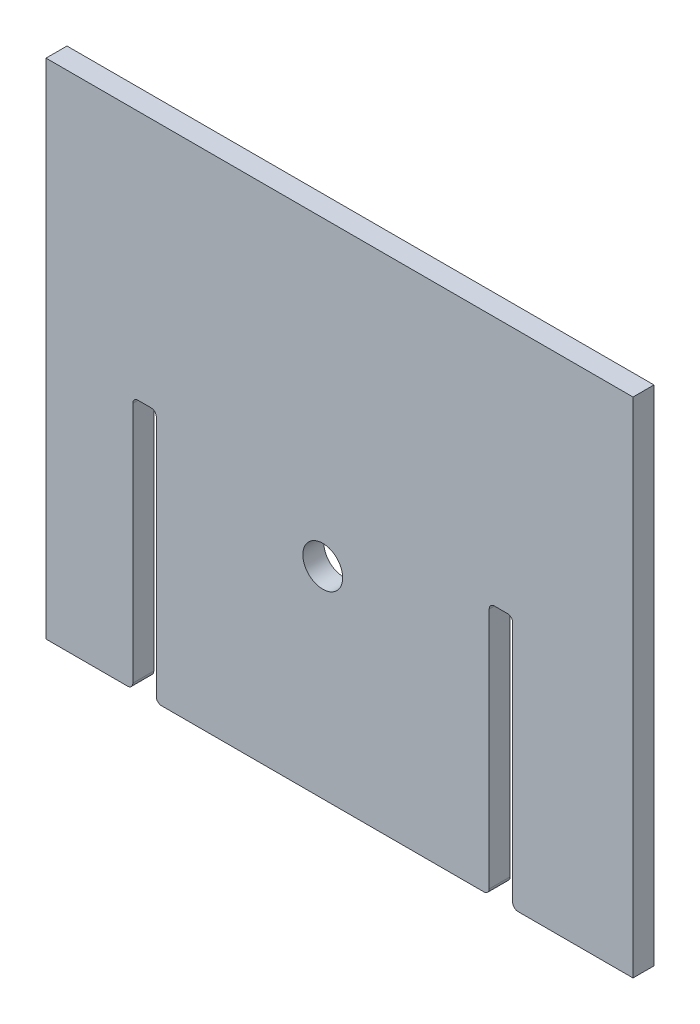
ISO-10303-21;
HEADER;
FILE_DESCRIPTION(('STEP AP214'),'2;1');
FILE_NAME('part.step','',(''),(''),'','','');
FILE_SCHEMA(('AUTOMOTIVE_DESIGN { 1 0 10303 214 1 1 1 1 }'));
ENDSEC;
DATA;
#1=APPLICATION_CONTEXT('core data for automotive mechanical design processes');
#2=APPLICATION_PROTOCOL_DEFINITION('international standard','automotive_design',2000,#1);
#3=PRODUCT_CONTEXT('',#1,'mechanical');
#4=PRODUCT('Part','Part','',(#3));
#5=PRODUCT_RELATED_PRODUCT_CATEGORY('part','',(#4));
#6=PRODUCT_DEFINITION_FORMATION('','',#4);
#7=PRODUCT_DEFINITION_CONTEXT('part definition',#1,'design');
#8=PRODUCT_DEFINITION('design','',#6,#7);
#9=PRODUCT_DEFINITION_SHAPE('','',#8);
#10=(LENGTH_UNIT() NAMED_UNIT(*) SI_UNIT(.MILLI.,.METRE.));
#11=(NAMED_UNIT(*) PLANE_ANGLE_UNIT() SI_UNIT($,.RADIAN.));
#12=(NAMED_UNIT(*) SI_UNIT($,.STERADIAN.) SOLID_ANGLE_UNIT());
#13=UNCERTAINTY_MEASURE_WITH_UNIT(LENGTH_MEASURE(1.E-05),#10,'distance_accuracy_value','');
#14=(GEOMETRIC_REPRESENTATION_CONTEXT(3) GLOBAL_UNCERTAINTY_ASSIGNED_CONTEXT((#13)) GLOBAL_UNIT_ASSIGNED_CONTEXT((#10,
#11,#12)) REPRESENTATION_CONTEXT('',''));
#15=CARTESIAN_POINT('',(0.,0.,0.));
#16=DIRECTION('',(0.,0.,1.));
#17=DIRECTION('',(1.,0.,0.));
#18=AXIS2_PLACEMENT_3D('',#15,#16,#17);
#19=CARTESIAN_POINT('',(784.937999999983,-3.43093008072127E-11,6.35));
#20=DIRECTION('',(1.,0.,0.));
#21=DIRECTION('',(0.,1.,0.));
#22=AXIS2_PLACEMENT_3D('',#19,#20,#21);
#23=PLANE('',#22);
#24=DIRECTION('',(0.,-1.,0.));
#25=VECTOR('',#24,1.);
#26=CARTESIAN_POINT('',(784.937999999983,-3.43093008072127E-11,6.35));
#27=LINE('',#26,#25);
#28=CARTESIAN_POINT('',(784.938000000006,530.986999999962,6.35));
#29=VERTEX_POINT('',#28);
#30=CARTESIAN_POINT('',(784.938,384.174999999962,6.35));
#31=VERTEX_POINT('',#30);
#32=EDGE_CURVE('E280',#29,#31,#27,.T.);
#33=ORIENTED_EDGE('',*,*,#32,.T.);
#34=DIRECTION('',(0.,0.,-1.));
#35=VECTOR('',#34,1.);
#36=CARTESIAN_POINT('',(784.938,384.174999999962,-6.35));
#37=LINE('',#36,#35);
#38=CARTESIAN_POINT('',(784.938,384.174999999962,-6.35));
#39=VERTEX_POINT('',#38);
#40=EDGE_CURVE('E341',#31,#39,#37,.T.);
#41=ORIENTED_EDGE('',*,*,#40,.T.);
#42=DIRECTION('',(0.,-1.,0.));
#43=VECTOR('',#42,1.);
#44=CARTESIAN_POINT('',(784.937999999983,-3.43093008072127E-11,-6.35));
#45=LINE('',#44,#43);
#46=CARTESIAN_POINT('',(784.938000000006,530.986999999962,-6.35));
#47=VERTEX_POINT('',#46);
#48=EDGE_CURVE('E217',#47,#39,#45,.T.);
#49=ORIENTED_EDGE('',*,*,#48,.F.);
#50=DIRECTION('',(0.,0.,-1.));
#51=VECTOR('',#50,1.);
#52=CARTESIAN_POINT('',(784.938000000006,530.986999999962,6.35));
#53=LINE('',#52,#51);
#54=EDGE_CURVE('E338',#47,#29,#53,.F.);
#55=ORIENTED_EDGE('',*,*,#54,.T.);
#56=EDGE_LOOP('',(#33,#41,#49,#55));
#57=FACE_BOUND('',#56,.T.);
#58=ADVANCED_FACE('F45',(#57),#23,.T.);
#59=CARTESIAN_POINT('',(0.,534.161999999962,6.35));
#60=DIRECTION('',(0.,1.,0.));
#61=DIRECTION('',(0.,0.,1.));
#62=AXIS2_PLACEMENT_3D('',#59,#60,#61);
#63=PLANE('',#62);
#64=DIRECTION('',(1.,0.,0.));
#65=VECTOR('',#64,1.);
#66=CARTESIAN_POINT('',(0.,534.161999999962,6.35));
#67=LINE('',#66,#65);
#68=CARTESIAN_POINT('',(788.113000000007,534.161999999962,6.35));
#69=VERTEX_POINT('',#68);
#70=CARTESIAN_POINT('',(795.986999999963,534.161999999962,6.35));
#71=VERTEX_POINT('',#70);
#72=EDGE_CURVE('E254',#69,#71,#67,.T.);
#73=ORIENTED_EDGE('',*,*,#72,.F.);
#74=DIRECTION('',(0.,0.,-1.));
#75=VECTOR('',#74,1.);
#76=CARTESIAN_POINT('',(788.113000000007,534.161999999962,6.35));
#77=LINE('',#76,#75);
#78=CARTESIAN_POINT('',(788.113000000007,534.161999999962,-6.35));
#79=VERTEX_POINT('',#78);
#80=EDGE_CURVE('E368',#69,#79,#77,.T.);
#81=ORIENTED_EDGE('',*,*,#80,.T.);
#82=DIRECTION('',(1.,0.,0.));
#83=VECTOR('',#82,1.);
#84=CARTESIAN_POINT('',(0.,534.161999999962,-6.35));
#85=LINE('',#84,#83);
#86=CARTESIAN_POINT('',(795.986999999963,534.161999999962,-6.35));
#87=VERTEX_POINT('',#86);
#88=EDGE_CURVE('E276',#79,#87,#85,.T.);
#89=ORIENTED_EDGE('',*,*,#88,.T.);
#90=DIRECTION('',(0.,0.,-1.));
#91=VECTOR('',#90,1.);
#92=CARTESIAN_POINT('',(795.986999999963,534.161999999962,6.35));
#93=LINE('',#92,#91);
#94=EDGE_CURVE('E365',#87,#71,#93,.F.);
#95=ORIENTED_EDGE('',*,*,#94,.T.);
#96=EDGE_LOOP('',(#73,#81,#89,#95));
#97=FACE_BOUND('',#96,.T.);
#98=ADVANCED_FACE('F455',(#97),#63,.F.);
#99=CARTESIAN_POINT('',(799.161999999964,0.,6.35));
#100=DIRECTION('',(-1.,0.,0.));
#101=DIRECTION('',(0.,0.,1.));
#102=AXIS2_PLACEMENT_3D('',#99,#100,#101);
#103=PLANE('',#102);
#104=DIRECTION('',(0.,1.,0.));
#105=VECTOR('',#104,1.);
#106=CARTESIAN_POINT('',(799.161999999964,0.,-6.35));
#107=LINE('',#106,#105);
#108=CARTESIAN_POINT('',(799.161999999964,384.174999999962,-6.35));
#109=VERTEX_POINT('',#108);
#110=CARTESIAN_POINT('',(799.161999999964,530.986999999962,-6.35));
#111=VERTEX_POINT('',#110);
#112=EDGE_CURVE('E263',#109,#111,#107,.T.);
#113=ORIENTED_EDGE('',*,*,#112,.F.);
#114=DIRECTION('',(0.,0.,-1.));
#115=VECTOR('',#114,1.);
#116=CARTESIAN_POINT('',(799.161999999964,384.174999999962,6.35));
#117=LINE('',#116,#115);
#118=CARTESIAN_POINT('',(799.161999999964,384.174999999962,6.35));
#119=VERTEX_POINT('',#118);
#120=EDGE_CURVE('E324',#109,#119,#117,.F.);
#121=ORIENTED_EDGE('',*,*,#120,.T.);
#122=DIRECTION('',(0.,1.,0.));
#123=VECTOR('',#122,1.);
#124=CARTESIAN_POINT('',(799.161999999964,0.,6.35));
#125=LINE('',#124,#123);
#126=CARTESIAN_POINT('',(799.161999999964,530.986999999962,6.35));
#127=VERTEX_POINT('',#126);
#128=EDGE_CURVE('E232',#119,#127,#125,.T.);
#129=ORIENTED_EDGE('',*,*,#128,.T.);
#130=DIRECTION('',(0.,0.,-1.));
#131=VECTOR('',#130,1.);
#132=CARTESIAN_POINT('',(799.161999999964,530.986999999962,6.35));
#133=LINE('',#132,#131);
#134=EDGE_CURVE('E320',#127,#111,#133,.T.);
#135=ORIENTED_EDGE('',*,*,#134,.T.);
#136=EDGE_LOOP('',(#113,#121,#129,#135));
#137=FACE_BOUND('',#136,.T.);
#138=ADVANCED_FACE('F463',(#137),#103,.T.);
#139=CARTESIAN_POINT('',(0.,380.999999999962,6.35));
#140=DIRECTION('',(0.,1.,0.));
#141=DIRECTION('',(0.,0.,1.));
#142=AXIS2_PLACEMENT_3D('',#139,#140,#141);
#143=PLANE('',#142);
#144=DIRECTION('',(1.,0.,0.));
#145=VECTOR('',#144,1.);
#146=CARTESIAN_POINT('',(0.,380.999999999962,6.35));
#147=LINE('',#146,#145);
#148=CARTESIAN_POINT('',(802.336999999963,380.999999999962,6.35));
#149=VERTEX_POINT('',#148);
#150=CARTESIAN_POINT('',(997.662999999995,380.999999999962,6.35));
#151=VERTEX_POINT('',#150);
#152=EDGE_CURVE('E250',#149,#151,#147,.T.);
#153=ORIENTED_EDGE('',*,*,#152,.F.);
#154=DIRECTION('',(0.,0.,-1.));
#155=VECTOR('',#154,1.);
#156=CARTESIAN_POINT('',(802.336999999963,380.999999999962,-6.35));
#157=LINE('',#156,#155);
#158=CARTESIAN_POINT('',(802.336999999963,380.999999999962,-6.35));
#159=VERTEX_POINT('',#158);
#160=EDGE_CURVE('E305',#149,#159,#157,.T.);
#161=ORIENTED_EDGE('',*,*,#160,.T.);
#162=DIRECTION('',(1.,0.,0.));
#163=VECTOR('',#162,1.);
#164=CARTESIAN_POINT('',(0.,380.999999999962,-6.35));
#165=LINE('',#164,#163);
#166=CARTESIAN_POINT('',(997.662999999995,380.999999999962,-6.35));
#167=VERTEX_POINT('',#166);
#168=EDGE_CURVE('E227',#159,#167,#165,.T.);
#169=ORIENTED_EDGE('',*,*,#168,.T.);
#170=DIRECTION('',(0.,0.,-1.));
#171=VECTOR('',#170,1.);
#172=CARTESIAN_POINT('',(997.662999999995,380.999999999962,6.35));
#173=LINE('',#172,#171);
#174=EDGE_CURVE('E302',#167,#151,#173,.F.);
#175=ORIENTED_EDGE('',*,*,#174,.T.);
#176=EDGE_LOOP('',(#153,#161,#169,#175));
#177=FACE_BOUND('',#176,.T.);
#178=ADVANCED_FACE('F471',(#177),#143,.F.);
#179=CARTESIAN_POINT('',(1000.83799999998,-3.79133703143229E-11,6.35));
#180=DIRECTION('',(1.,0.,0.));
#181=DIRECTION('',(0.,1.,0.));
#182=AXIS2_PLACEMENT_3D('',#179,#180,#181);
#183=PLANE('',#182);
#184=DIRECTION('',(0.,-1.,0.));
#185=VECTOR('',#184,1.);
#186=CARTESIAN_POINT('',(1000.83799999998,-3.79133703143229E-11,6.35));
#187=LINE('',#186,#185);
#188=CARTESIAN_POINT('',(1000.838,530.986999999962,6.35));
#189=VERTEX_POINT('',#188);
#190=CARTESIAN_POINT('',(1000.838,384.174999999962,6.35));
#191=VERTEX_POINT('',#190);
#192=EDGE_CURVE('E231',#189,#191,#187,.T.);
#193=ORIENTED_EDGE('',*,*,#192,.T.);
#194=DIRECTION('',(0.,0.,-1.));
#195=VECTOR('',#194,1.);
#196=CARTESIAN_POINT('',(1000.838,384.174999999962,-6.35));
#197=LINE('',#196,#195);
#198=CARTESIAN_POINT('',(1000.838,384.174999999962,-6.35));
#199=VERTEX_POINT('',#198);
#200=EDGE_CURVE('E361',#191,#199,#197,.T.);
#201=ORIENTED_EDGE('',*,*,#200,.T.);
#202=DIRECTION('',(0.,-1.,0.));
#203=VECTOR('',#202,1.);
#204=CARTESIAN_POINT('',(1000.83799999998,-3.79133703143229E-11,-6.35));
#205=LINE('',#204,#203);
#206=CARTESIAN_POINT('',(1000.838,530.986999999962,-6.35));
#207=VERTEX_POINT('',#206);
#208=EDGE_CURVE('E259',#207,#199,#205,.T.);
#209=ORIENTED_EDGE('',*,*,#208,.F.);
#210=DIRECTION('',(0.,0.,-1.));
#211=VECTOR('',#210,1.);
#212=CARTESIAN_POINT('',(1000.838,530.986999999962,6.35));
#213=LINE('',#212,#211);
#214=EDGE_CURVE('E358',#207,#189,#213,.F.);
#215=ORIENTED_EDGE('',*,*,#214,.T.);
#216=EDGE_LOOP('',(#193,#201,#209,#215));
#217=FACE_BOUND('',#216,.T.);
#218=ADVANCED_FACE('F403',(#217),#183,.T.);
#219=CARTESIAN_POINT('',(0.,534.161999999962,6.35));
#220=DIRECTION('',(0.,1.,0.));
#221=DIRECTION('',(0.,0.,1.));
#222=AXIS2_PLACEMENT_3D('',#219,#220,#221);
#223=PLANE('',#222);
#224=DIRECTION('',(1.,0.,0.));
#225=VECTOR('',#224,1.);
#226=CARTESIAN_POINT('',(0.,534.161999999962,-6.35));
#227=LINE('',#226,#225);
#228=CARTESIAN_POINT('',(1004.013,534.161999999962,-6.35));
#229=VERTEX_POINT('',#228);
#230=CARTESIAN_POINT('',(1011.88699999996,534.161999999962,-6.35));
#231=VERTEX_POINT('',#230);
#232=EDGE_CURVE('E255',#229,#231,#227,.T.);
#233=ORIENTED_EDGE('',*,*,#232,.T.);
#234=DIRECTION('',(0.,0.,-1.));
#235=VECTOR('',#234,1.);
#236=CARTESIAN_POINT('',(1011.88699999996,534.161999999962,6.35));
#237=LINE('',#236,#235);
#238=CARTESIAN_POINT('',(1011.88699999996,534.161999999962,6.35));
#239=VERTEX_POINT('',#238);
#240=EDGE_CURVE('E376',#231,#239,#237,.F.);
#241=ORIENTED_EDGE('',*,*,#240,.T.);
#242=DIRECTION('',(1.,0.,0.));
#243=VECTOR('',#242,1.);
#244=CARTESIAN_POINT('',(0.,534.161999999962,6.35));
#245=LINE('',#244,#243);
#246=CARTESIAN_POINT('',(1004.013,534.161999999962,6.35));
#247=VERTEX_POINT('',#246);
#248=EDGE_CURVE('E249',#247,#239,#245,.T.);
#249=ORIENTED_EDGE('',*,*,#248,.F.);
#250=DIRECTION('',(0.,0.,-1.));
#251=VECTOR('',#250,1.);
#252=CARTESIAN_POINT('',(1004.013,534.161999999962,6.35));
#253=LINE('',#252,#251);
#254=EDGE_CURVE('E372',#247,#229,#253,.T.);
#255=ORIENTED_EDGE('',*,*,#254,.T.);
#256=EDGE_LOOP('',(#233,#241,#249,#255));
#257=FACE_BOUND('',#256,.T.);
#258=ADVANCED_FACE('F412',(#257),#223,.F.);
#259=CARTESIAN_POINT('',(1015.06199999996,0.,6.35));
#260=DIRECTION('',(-1.,0.,0.));
#261=DIRECTION('',(0.,0.,1.));
#262=AXIS2_PLACEMENT_3D('',#259,#260,#261);
#263=PLANE('',#262);
#264=DIRECTION('',(0.,1.,0.));
#265=VECTOR('',#264,1.);
#266=CARTESIAN_POINT('',(1015.06199999996,0.,-6.35));
#267=LINE('',#266,#265);
#268=CARTESIAN_POINT('',(1015.06199999996,384.174999999962,-6.35));
#269=VERTEX_POINT('',#268);
#270=CARTESIAN_POINT('',(1015.06199999996,530.986999999962,-6.35));
#271=VERTEX_POINT('',#270);
#272=EDGE_CURVE('E221',#269,#271,#267,.T.);
#273=ORIENTED_EDGE('',*,*,#272,.F.);
#274=DIRECTION('',(0.,0.,-1.));
#275=VECTOR('',#274,1.);
#276=CARTESIAN_POINT('',(1015.06199999996,384.174999999962,6.35));
#277=LINE('',#276,#275);
#278=CARTESIAN_POINT('',(1015.06199999996,384.174999999962,6.35));
#279=VERTEX_POINT('',#278);
#280=EDGE_CURVE('E355',#269,#279,#277,.F.);
#281=ORIENTED_EDGE('',*,*,#280,.T.);
#282=DIRECTION('',(0.,1.,0.));
#283=VECTOR('',#282,1.);
#284=CARTESIAN_POINT('',(1015.06199999996,0.,6.35));
#285=LINE('',#284,#283);
#286=CARTESIAN_POINT('',(1015.06199999996,530.986999999962,6.35));
#287=VERTEX_POINT('',#286);
#288=EDGE_CURVE('E226',#279,#287,#285,.T.);
#289=ORIENTED_EDGE('',*,*,#288,.T.);
#290=DIRECTION('',(0.,0.,-1.));
#291=VECTOR('',#290,1.);
#292=CARTESIAN_POINT('',(1015.06199999996,530.986999999962,6.35));
#293=LINE('',#292,#291);
#294=EDGE_CURVE('E351',#287,#271,#293,.T.);
#295=ORIENTED_EDGE('',*,*,#294,.T.);
#296=EDGE_LOOP('',(#273,#281,#289,#295));
#297=FACE_BOUND('',#296,.T.);
#298=ADVANCED_FACE('F419',(#297),#263,.T.);
#299=CARTESIAN_POINT('',(0.,380.999999999962,6.35));
#300=DIRECTION('',(0.,1.,0.));
#301=DIRECTION('',(0.,0.,1.));
#302=AXIS2_PLACEMENT_3D('',#299,#300,#301);
#303=PLANE('',#302);
#304=DIRECTION('',(1.,0.,0.));
#305=VECTOR('',#304,1.);
#306=CARTESIAN_POINT('',(0.,380.999999999962,6.35));
#307=LINE('',#306,#305);
#308=CARTESIAN_POINT('',(1018.23699999996,380.999999999962,6.35));
#309=VERTEX_POINT('',#308);
#310=CARTESIAN_POINT('',(1087.95999999996,380.999999999962,6.35));
#311=VERTEX_POINT('',#310);
#312=EDGE_CURVE('E238',#309,#311,#307,.T.);
#313=ORIENTED_EDGE('',*,*,#312,.F.);
#314=DIRECTION('',(0.,0.,-1.));
#315=VECTOR('',#314,1.);
#316=CARTESIAN_POINT('',(1018.23699999996,380.999999999962,-6.35));
#317=LINE('',#316,#315);
#318=CARTESIAN_POINT('',(1018.23699999996,380.999999999962,-6.35));
#319=VERTEX_POINT('',#318);
#320=EDGE_CURVE('E347',#309,#319,#317,.T.);
#321=ORIENTED_EDGE('',*,*,#320,.T.);
#322=DIRECTION('',(1.,0.,0.));
#323=VECTOR('',#322,1.);
#324=CARTESIAN_POINT('',(0.,380.999999999962,-6.35));
#325=LINE('',#324,#323);
#326=CARTESIAN_POINT('',(1087.95999999996,380.999999999962,-6.35));
#327=VERTEX_POINT('',#326);
#328=EDGE_CURVE('E222',#319,#327,#325,.T.);
#329=ORIENTED_EDGE('',*,*,#328,.T.);
#330=DIRECTION('',(0.,0.,-1.));
#331=VECTOR('',#330,1.);
#332=CARTESIAN_POINT('',(1087.95999999996,380.999999999962,6.35));
#333=LINE('',#332,#331);
#334=EDGE_CURVE('E243',#311,#327,#333,.T.);
#335=ORIENTED_EDGE('',*,*,#334,.F.);
#336=EDGE_LOOP('',(#313,#321,#329,#335));
#337=FACE_BOUND('',#336,.T.);
#338=ADVANCED_FACE('F426',(#337),#303,.F.);
#339=CARTESIAN_POINT('',(1087.95999999996,0.,6.35));
#340=DIRECTION('',(1.,0.,0.));
#341=DIRECTION('',(0.,0.,-1.));
#342=AXIS2_PLACEMENT_3D('',#339,#340,#341);
#343=PLANE('',#342);
#344=DIRECTION('',(0.,-1.,0.));
#345=VECTOR('',#344,1.);
#346=CARTESIAN_POINT('',(1087.95999999996,0.,-6.35));
#347=LINE('',#346,#345);
#348=CARTESIAN_POINT('',(1087.95999999996,685.799999999962,-6.35));
#349=VERTEX_POINT('',#348);
#350=EDGE_CURVE('E216',#349,#327,#347,.T.);
#351=ORIENTED_EDGE('',*,*,#350,.F.);
#352=DIRECTION('',(0.,0.,-1.));
#353=VECTOR('',#352,1.);
#354=CARTESIAN_POINT('',(1087.95999999996,685.799999999962,6.35));
#355=LINE('',#354,#353);
#356=CARTESIAN_POINT('',(1087.95999999996,685.799999999962,6.35));
#357=VERTEX_POINT('',#356);
#358=EDGE_CURVE('E196',#357,#349,#355,.T.);
#359=ORIENTED_EDGE('',*,*,#358,.F.);
#360=DIRECTION('',(0.,-1.,0.));
#361=VECTOR('',#360,1.);
#362=CARTESIAN_POINT('',(1087.95999999996,0.,6.35));
#363=LINE('',#362,#361);
#364=EDGE_CURVE('E225',#357,#311,#363,.T.);
#365=ORIENTED_EDGE('',*,*,#364,.T.);
#366=ORIENTED_EDGE('',*,*,#334,.T.);
#367=EDGE_LOOP('',(#351,#359,#365,#366));
#368=FACE_BOUND('',#367,.T.);
#369=ADVANCED_FACE('F431',(#368),#343,.T.);
#370=CARTESIAN_POINT('',(4.4082384801313E-12,685.799999999969,6.35));
#371=DIRECTION('',(0.,1.,0.));
#372=DIRECTION('',(-1.,0.,0.));
#373=AXIS2_PLACEMENT_3D('',#370,#371,#372);
#374=PLANE('',#373);
#375=DIRECTION('',(1.,0.,0.));
#376=VECTOR('',#375,1.);
#377=CARTESIAN_POINT('',(4.4082384801313E-12,685.799999999969,-6.35));
#378=LINE('',#377,#376);
#379=CARTESIAN_POINT('',(732.359999999964,685.799999999962,-6.35));
#380=VERTEX_POINT('',#379);
#381=EDGE_CURVE('E213',#380,#349,#378,.T.);
#382=ORIENTED_EDGE('',*,*,#381,.F.);
#383=DIRECTION('',(0.,0.,-1.));
#384=VECTOR('',#383,1.);
#385=CARTESIAN_POINT('',(732.359999999964,685.799999999962,6.35));
#386=LINE('',#385,#384);
#387=CARTESIAN_POINT('',(732.359999999964,685.799999999962,6.35));
#388=VERTEX_POINT('',#387);
#389=EDGE_CURVE('E190',#388,#380,#386,.T.);
#390=ORIENTED_EDGE('',*,*,#389,.F.);
#391=DIRECTION('',(1.,0.,0.));
#392=VECTOR('',#391,1.);
#393=CARTESIAN_POINT('',(4.4082384801313E-12,685.799999999969,6.35));
#394=LINE('',#393,#392);
#395=EDGE_CURVE('E239',#388,#357,#394,.T.);
#396=ORIENTED_EDGE('',*,*,#395,.T.);
#397=ORIENTED_EDGE('',*,*,#358,.T.);
#398=EDGE_LOOP('',(#382,#390,#396,#397));
#399=FACE_BOUND('',#398,.T.);
#400=ADVANCED_FACE('F438',(#399),#374,.T.);
#401=CARTESIAN_POINT('',(732.359999999964,0.,6.35));
#402=DIRECTION('',(1.,0.,0.));
#403=DIRECTION('',(0.,0.,-1.));
#404=AXIS2_PLACEMENT_3D('',#401,#402,#403);
#405=PLANE('',#404);
#406=DIRECTION('',(0.,-1.,0.));
#407=VECTOR('',#406,1.);
#408=CARTESIAN_POINT('',(732.359999999964,0.,-6.35));
#409=LINE('',#408,#407);
#410=CARTESIAN_POINT('',(732.359999999964,380.999999999962,-6.35));
#411=VERTEX_POINT('',#410);
#412=EDGE_CURVE('E185',#380,#411,#409,.T.);
#413=ORIENTED_EDGE('',*,*,#412,.T.);
#414=DIRECTION('',(0.,0.,-1.));
#415=VECTOR('',#414,1.);
#416=CARTESIAN_POINT('',(732.359999999964,380.999999999962,6.35));
#417=LINE('',#416,#415);
#418=CARTESIAN_POINT('',(732.359999999964,380.999999999962,6.35));
#419=VERTEX_POINT('',#418);
#420=EDGE_CURVE('E189',#419,#411,#417,.T.);
#421=ORIENTED_EDGE('',*,*,#420,.F.);
#422=DIRECTION('',(0.,-1.,0.));
#423=VECTOR('',#422,1.);
#424=CARTESIAN_POINT('',(732.359999999964,0.,6.35));
#425=LINE('',#424,#423);
#426=EDGE_CURVE('E235',#388,#419,#425,.T.);
#427=ORIENTED_EDGE('',*,*,#426,.F.);
#428=ORIENTED_EDGE('',*,*,#389,.T.);
#429=EDGE_LOOP('',(#413,#421,#427,#428));
#430=FACE_BOUND('',#429,.T.);
#431=ADVANCED_FACE('F187',(#430),#405,.F.);
#432=CARTESIAN_POINT('',(0.,380.999999999962,6.35));
#433=DIRECTION('',(0.,1.,0.));
#434=DIRECTION('',(0.,0.,1.));
#435=AXIS2_PLACEMENT_3D('',#432,#433,#434);
#436=PLANE('',#435);
#437=DIRECTION('',(1.,0.,0.));
#438=VECTOR('',#437,1.);
#439=CARTESIAN_POINT('',(0.,380.999999999962,-6.35));
#440=LINE('',#439,#438);
#441=CARTESIAN_POINT('',(781.763,380.999999999962,-6.35));
#442=VERTEX_POINT('',#441);
#443=EDGE_CURVE('E199',#411,#442,#440,.T.);
#444=ORIENTED_EDGE('',*,*,#443,.T.);
#445=DIRECTION('',(0.,0.,-1.));
#446=VECTOR('',#445,1.);
#447=CARTESIAN_POINT('',(781.763,380.999999999962,6.35));
#448=LINE('',#447,#446);
#449=CARTESIAN_POINT('',(781.763,380.999999999962,6.35));
#450=VERTEX_POINT('',#449);
#451=EDGE_CURVE('E61',#442,#450,#448,.F.);
#452=ORIENTED_EDGE('',*,*,#451,.T.);
#453=DIRECTION('',(1.,0.,0.));
#454=VECTOR('',#453,1.);
#455=CARTESIAN_POINT('',(0.,380.999999999962,6.35));
#456=LINE('',#455,#454);
#457=EDGE_CURVE('E200',#419,#450,#456,.T.);
#458=ORIENTED_EDGE('',*,*,#457,.F.);
#459=ORIENTED_EDGE('',*,*,#420,.T.);
#460=EDGE_LOOP('',(#444,#452,#458,#459));
#461=FACE_BOUND('',#460,.T.);
#462=ADVANCED_FACE('F198',(#461),#436,.F.);
#463=CARTESIAN_POINT('',(0.,0.,6.35));
#464=DIRECTION('',(0.,0.,1.));
#465=DIRECTION('',(1.,0.,0.));
#466=AXIS2_PLACEMENT_3D('',#463,#464,#465);
#467=PLANE('',#466);
#468=CARTESIAN_POINT('',(900.,503.049546279118,6.34999999999999));
#469=DIRECTION('',(0.,0.,1.));
#470=DIRECTION('',(1.,0.,0.));
#471=AXIS2_PLACEMENT_3D('',#468,#469,#470);
#472=CIRCLE('',#471,12.065);
#473=CARTESIAN_POINT('',(912.065,503.049546279118,6.34999999999999));
#474=VERTEX_POINT('',#473);
#475=EDGE_CURVE('E202',#474,#474,#472,.F.);
#476=ORIENTED_EDGE('',*,*,#475,.T.);
#477=EDGE_LOOP('',(#476));
#478=FACE_BOUND('',#477,.T.);
#479=ORIENTED_EDGE('',*,*,#128,.F.);
#480=CARTESIAN_POINT('',(802.336999999963,384.174999999962,6.35));
#481=DIRECTION('',(0.,0.,1.));
#482=DIRECTION('',(1.,0.,0.));
#483=AXIS2_PLACEMENT_3D('',#480,#481,#482);
#484=CIRCLE('',#483,3.175);
#485=EDGE_CURVE('E335',#119,#149,#484,.T.);
#486=ORIENTED_EDGE('',*,*,#485,.T.);
#487=ORIENTED_EDGE('',*,*,#152,.T.);
#488=CARTESIAN_POINT('',(997.662999999995,384.174999999962,6.35));
#489=DIRECTION('',(0.,0.,1.));
#490=DIRECTION('',(1.,0.,0.));
#491=AXIS2_PLACEMENT_3D('',#488,#489,#490);
#492=CIRCLE('',#491,3.175);
#493=EDGE_CURVE('E327',#151,#191,#492,.T.);
#494=ORIENTED_EDGE('',*,*,#493,.T.);
#495=ORIENTED_EDGE('',*,*,#192,.F.);
#496=CARTESIAN_POINT('',(1004.013,530.986999999962,6.35));
#497=DIRECTION('',(0.,0.,1.));
#498=DIRECTION('',(1.,0.,0.));
#499=AXIS2_PLACEMENT_3D('',#496,#497,#498);
#500=CIRCLE('',#499,3.175);
#501=EDGE_CURVE('E12',#189,#247,#500,.F.);
#502=ORIENTED_EDGE('',*,*,#501,.T.);
#503=ORIENTED_EDGE('',*,*,#248,.T.);
#504=CARTESIAN_POINT('',(1011.88699999996,530.986999999962,6.35));
#505=DIRECTION('',(0.,0.,1.));
#506=DIRECTION('',(1.,0.,0.));
#507=AXIS2_PLACEMENT_3D('',#504,#505,#506);
#508=CIRCLE('',#507,3.175);
#509=EDGE_CURVE('E394',#239,#287,#508,.F.);
#510=ORIENTED_EDGE('',*,*,#509,.T.);
#511=ORIENTED_EDGE('',*,*,#288,.F.);
#512=CARTESIAN_POINT('',(1018.23699999996,384.174999999962,6.35));
#513=DIRECTION('',(0.,0.,1.));
#514=DIRECTION('',(1.,0.,0.));
#515=AXIS2_PLACEMENT_3D('',#512,#513,#514);
#516=CIRCLE('',#515,3.175);
#517=EDGE_CURVE('E69',#279,#309,#516,.T.);
#518=ORIENTED_EDGE('',*,*,#517,.T.);
#519=ORIENTED_EDGE('',*,*,#312,.T.);
#520=ORIENTED_EDGE('',*,*,#364,.F.);
#521=ORIENTED_EDGE('',*,*,#395,.F.);
#522=ORIENTED_EDGE('',*,*,#426,.T.);
#523=ORIENTED_EDGE('',*,*,#457,.T.);
#524=CARTESIAN_POINT('',(781.763,384.174999999962,6.35));
#525=DIRECTION('',(0.,0.,1.));
#526=DIRECTION('',(1.,0.,0.));
#527=AXIS2_PLACEMENT_3D('',#524,#525,#526);
#528=CIRCLE('',#527,3.175);
#529=EDGE_CURVE('E332',#450,#31,#528,.T.);
#530=ORIENTED_EDGE('',*,*,#529,.T.);
#531=ORIENTED_EDGE('',*,*,#32,.F.);
#532=CARTESIAN_POINT('',(788.113000000007,530.986999999962,6.35));
#533=DIRECTION('',(0.,0.,1.));
#534=DIRECTION('',(1.,0.,0.));
#535=AXIS2_PLACEMENT_3D('',#532,#533,#534);
#536=CIRCLE('',#535,3.175);
#537=EDGE_CURVE('E382',#29,#69,#536,.F.);
#538=ORIENTED_EDGE('',*,*,#537,.T.);
#539=ORIENTED_EDGE('',*,*,#72,.T.);
#540=CARTESIAN_POINT('',(795.986999999963,530.986999999962,6.35));
#541=DIRECTION('',(0.,0.,1.));
#542=DIRECTION('',(1.,0.,0.));
#543=AXIS2_PLACEMENT_3D('',#540,#541,#542);
#544=CIRCLE('',#543,3.175);
#545=EDGE_CURVE('E388',#71,#127,#544,.F.);
#546=ORIENTED_EDGE('',*,*,#545,.T.);
#547=EDGE_LOOP('',(#479,#486,#487,#494,#495,#502,#503,#510,#511,#518,#519,#520,#521,#522,#523,
#530,#531,#538,#539,#546));
#548=FACE_BOUND('',#547,.T.);
#549=ADVANCED_FACE('F409',(#478,#548),#467,.T.);
#550=CARTESIAN_POINT('',(0.,0.,-6.35));
#551=DIRECTION('',(0.,0.,1.));
#552=DIRECTION('',(1.,0.,0.));
#553=AXIS2_PLACEMENT_3D('',#550,#551,#552);
#554=PLANE('',#553);
#555=CARTESIAN_POINT('',(900.,503.049546279118,-6.34999999999999));
#556=DIRECTION('',(0.,0.,1.));
#557=DIRECTION('',(1.,0.,0.));
#558=AXIS2_PLACEMENT_3D('',#555,#556,#557);
#559=CIRCLE('',#558,12.065);
#560=CARTESIAN_POINT('',(912.065,503.049546279118,-6.34999999999999));
#561=VERTEX_POINT('',#560);
#562=EDGE_CURVE('E295',#561,#561,#559,.F.);
#563=ORIENTED_EDGE('',*,*,#562,.F.);
#564=EDGE_LOOP('',(#563));
#565=FACE_BOUND('',#564,.T.);
#566=ORIENTED_EDGE('',*,*,#168,.F.);
#567=CARTESIAN_POINT('',(802.336999999963,384.174999999962,-6.35));
#568=DIRECTION('',(0.,0.,1.));
#569=DIRECTION('',(1.,0.,0.));
#570=AXIS2_PLACEMENT_3D('',#567,#568,#569);
#571=CIRCLE('',#570,3.175);
#572=EDGE_CURVE('E317',#159,#109,#571,.F.);
#573=ORIENTED_EDGE('',*,*,#572,.T.);
#574=ORIENTED_EDGE('',*,*,#112,.T.);
#575=CARTESIAN_POINT('',(795.986999999963,530.986999999962,-6.35));
#576=DIRECTION('',(0.,0.,1.));
#577=DIRECTION('',(1.,0.,0.));
#578=AXIS2_PLACEMENT_3D('',#575,#576,#577);
#579=CIRCLE('',#578,3.175);
#580=EDGE_CURVE('E385',#111,#87,#579,.T.);
#581=ORIENTED_EDGE('',*,*,#580,.T.);
#582=ORIENTED_EDGE('',*,*,#88,.F.);
#583=CARTESIAN_POINT('',(788.113000000007,530.986999999962,-6.35));
#584=DIRECTION('',(0.,0.,1.));
#585=DIRECTION('',(1.,0.,0.));
#586=AXIS2_PLACEMENT_3D('',#583,#584,#585);
#587=CIRCLE('',#586,3.175);
#588=EDGE_CURVE('E379',#79,#47,#587,.T.);
#589=ORIENTED_EDGE('',*,*,#588,.T.);
#590=ORIENTED_EDGE('',*,*,#48,.T.);
#591=CARTESIAN_POINT('',(781.763,384.174999999962,-6.35));
#592=DIRECTION('',(0.,0.,1.));
#593=DIRECTION('',(1.,0.,0.));
#594=AXIS2_PLACEMENT_3D('',#591,#592,#593);
#595=CIRCLE('',#594,3.175);
#596=EDGE_CURVE('E207',#39,#442,#595,.F.);
#597=ORIENTED_EDGE('',*,*,#596,.T.);
#598=ORIENTED_EDGE('',*,*,#443,.F.);
#599=ORIENTED_EDGE('',*,*,#412,.F.);
#600=ORIENTED_EDGE('',*,*,#381,.T.);
#601=ORIENTED_EDGE('',*,*,#350,.T.);
#602=ORIENTED_EDGE('',*,*,#328,.F.);
#603=CARTESIAN_POINT('',(1018.23699999996,384.174999999962,-6.35));
#604=DIRECTION('',(0.,0.,1.));
#605=DIRECTION('',(1.,0.,0.));
#606=AXIS2_PLACEMENT_3D('',#603,#604,#605);
#607=CIRCLE('',#606,3.175);
#608=EDGE_CURVE('E312',#319,#269,#607,.F.);
#609=ORIENTED_EDGE('',*,*,#608,.T.);
#610=ORIENTED_EDGE('',*,*,#272,.T.);
#611=CARTESIAN_POINT('',(1011.88699999996,530.986999999962,-6.35));
#612=DIRECTION('',(0.,0.,1.));
#613=DIRECTION('',(1.,0.,0.));
#614=AXIS2_PLACEMENT_3D('',#611,#612,#613);
#615=CIRCLE('',#614,3.175);
#616=EDGE_CURVE('E391',#271,#231,#615,.T.);
#617=ORIENTED_EDGE('',*,*,#616,.T.);
#618=ORIENTED_EDGE('',*,*,#232,.F.);
#619=CARTESIAN_POINT('',(1004.013,530.986999999962,-6.35));
#620=DIRECTION('',(0.,0.,1.));
#621=DIRECTION('',(1.,0.,0.));
#622=AXIS2_PLACEMENT_3D('',#619,#620,#621);
#623=CIRCLE('',#622,3.175);
#624=EDGE_CURVE('E54',#229,#207,#623,.T.);
#625=ORIENTED_EDGE('',*,*,#624,.T.);
#626=ORIENTED_EDGE('',*,*,#208,.T.);
#627=CARTESIAN_POINT('',(997.662999999995,384.174999999962,-6.35));
#628=DIRECTION('',(0.,0.,1.));
#629=DIRECTION('',(1.,0.,0.));
#630=AXIS2_PLACEMENT_3D('',#627,#628,#629);
#631=CIRCLE('',#630,3.175);
#632=EDGE_CURVE('E309',#199,#167,#631,.F.);
#633=ORIENTED_EDGE('',*,*,#632,.T.);
#634=EDGE_LOOP('',(#566,#573,#574,#581,#582,#589,#590,#597,#598,#599,#600,#601,#602,#609,#610,
#617,#618,#625,#626,#633));
#635=FACE_BOUND('',#634,.T.);
#636=ADVANCED_FACE('F205',(#565,#635),#554,.F.);
#637=CARTESIAN_POINT('',(900.,503.049546279118,167.449999999999));
#638=DIRECTION('',(0.,0.,-1.));
#639=DIRECTION('',(-1.,0.,0.));
#640=AXIS2_PLACEMENT_3D('',#637,#638,#639);
#641=CYLINDRICAL_SURFACE('',#640,12.065);
#642=ORIENTED_EDGE('',*,*,#475,.F.);
#643=EDGE_LOOP('',(#642));
#644=FACE_BOUND('',#643,.T.);
#645=ORIENTED_EDGE('',*,*,#562,.T.);
#646=EDGE_LOOP('',(#645));
#647=FACE_BOUND('',#646,.T.);
#648=ADVANCED_FACE('F494',(#644,#647),#641,.F.);
#649=CARTESIAN_POINT('',(802.336999999963,384.174999999962,6.35));
#650=DIRECTION('',(0.,0.,1.));
#651=DIRECTION('',(1.,0.,0.));
#652=AXIS2_PLACEMENT_3D('',#649,#650,#651);
#653=CYLINDRICAL_SURFACE('',#652,3.175);
#654=ORIENTED_EDGE('',*,*,#485,.F.);
#655=ORIENTED_EDGE('',*,*,#120,.F.);
#656=ORIENTED_EDGE('',*,*,#572,.F.);
#657=ORIENTED_EDGE('',*,*,#160,.F.);
#658=EDGE_LOOP('',(#654,#655,#656,#657));
#659=FACE_BOUND('',#658,.T.);
#660=ADVANCED_FACE('F468',(#659),#653,.T.);
#661=CARTESIAN_POINT('',(781.763,384.174999999962,6.35));
#662=DIRECTION('',(0.,0.,1.));
#663=DIRECTION('',(1.,0.,0.));
#664=AXIS2_PLACEMENT_3D('',#661,#662,#663);
#665=CYLINDRICAL_SURFACE('',#664,3.175);
#666=ORIENTED_EDGE('',*,*,#529,.F.);
#667=ORIENTED_EDGE('',*,*,#451,.F.);
#668=ORIENTED_EDGE('',*,*,#596,.F.);
#669=ORIENTED_EDGE('',*,*,#40,.F.);
#670=EDGE_LOOP('',(#666,#667,#668,#669));
#671=FACE_BOUND('',#670,.T.);
#672=ADVANCED_FACE('F444',(#671),#665,.T.);
#673=CARTESIAN_POINT('',(1018.23699999996,384.174999999962,6.35));
#674=DIRECTION('',(0.,0.,1.));
#675=DIRECTION('',(1.,0.,0.));
#676=AXIS2_PLACEMENT_3D('',#673,#674,#675);
#677=CYLINDRICAL_SURFACE('',#676,3.175);
#678=ORIENTED_EDGE('',*,*,#517,.F.);
#679=ORIENTED_EDGE('',*,*,#280,.F.);
#680=ORIENTED_EDGE('',*,*,#608,.F.);
#681=ORIENTED_EDGE('',*,*,#320,.F.);
#682=EDGE_LOOP('',(#678,#679,#680,#681));
#683=FACE_BOUND('',#682,.T.);
#684=ADVANCED_FACE('F422',(#683),#677,.T.);
#685=CARTESIAN_POINT('',(997.662999999995,384.174999999962,6.35));
#686=DIRECTION('',(0.,0.,1.));
#687=DIRECTION('',(1.,0.,0.));
#688=AXIS2_PLACEMENT_3D('',#685,#686,#687);
#689=CYLINDRICAL_SURFACE('',#688,3.175);
#690=ORIENTED_EDGE('',*,*,#493,.F.);
#691=ORIENTED_EDGE('',*,*,#174,.F.);
#692=ORIENTED_EDGE('',*,*,#632,.F.);
#693=ORIENTED_EDGE('',*,*,#200,.F.);
#694=EDGE_LOOP('',(#690,#691,#692,#693));
#695=FACE_BOUND('',#694,.T.);
#696=ADVANCED_FACE('F475',(#695),#689,.T.);
#697=CARTESIAN_POINT('',(788.113000000007,530.986999999962,6.35));
#698=DIRECTION('',(0.,0.,-1.));
#699=DIRECTION('',(-1.,0.,0.));
#700=AXIS2_PLACEMENT_3D('',#697,#698,#699);
#701=CYLINDRICAL_SURFACE('',#700,3.175);
#702=ORIENTED_EDGE('',*,*,#537,.F.);
#703=ORIENTED_EDGE('',*,*,#54,.F.);
#704=ORIENTED_EDGE('',*,*,#588,.F.);
#705=ORIENTED_EDGE('',*,*,#80,.F.);
#706=EDGE_LOOP('',(#702,#703,#704,#705));
#707=FACE_BOUND('',#706,.T.);
#708=ADVANCED_FACE('F452',(#707),#701,.F.);
#709=CARTESIAN_POINT('',(795.986999999963,530.986999999962,6.35));
#710=DIRECTION('',(0.,0.,-1.));
#711=DIRECTION('',(-1.,0.,0.));
#712=AXIS2_PLACEMENT_3D('',#709,#710,#711);
#713=CYLINDRICAL_SURFACE('',#712,3.175);
#714=ORIENTED_EDGE('',*,*,#545,.F.);
#715=ORIENTED_EDGE('',*,*,#94,.F.);
#716=ORIENTED_EDGE('',*,*,#580,.F.);
#717=ORIENTED_EDGE('',*,*,#134,.F.);
#718=EDGE_LOOP('',(#714,#715,#716,#717));
#719=FACE_BOUND('',#718,.T.);
#720=ADVANCED_FACE('F460',(#719),#713,.F.);
#721=CARTESIAN_POINT('',(1011.88699999996,530.986999999962,6.35));
#722=DIRECTION('',(0.,0.,-1.));
#723=DIRECTION('',(-1.,0.,0.));
#724=AXIS2_PLACEMENT_3D('',#721,#722,#723);
#725=CYLINDRICAL_SURFACE('',#724,3.175);
#726=ORIENTED_EDGE('',*,*,#509,.F.);
#727=ORIENTED_EDGE('',*,*,#240,.F.);
#728=ORIENTED_EDGE('',*,*,#616,.F.);
#729=ORIENTED_EDGE('',*,*,#294,.F.);
#730=EDGE_LOOP('',(#726,#727,#728,#729));
#731=FACE_BOUND('',#730,.T.);
#732=ADVANCED_FACE('F415',(#731),#725,.F.);
#733=CARTESIAN_POINT('',(1004.013,530.986999999962,6.35));
#734=DIRECTION('',(0.,0.,-1.));
#735=DIRECTION('',(-1.,0.,0.));
#736=AXIS2_PLACEMENT_3D('',#733,#734,#735);
#737=CYLINDRICAL_SURFACE('',#736,3.175);
#738=ORIENTED_EDGE('',*,*,#501,.F.);
#739=ORIENTED_EDGE('',*,*,#214,.F.);
#740=ORIENTED_EDGE('',*,*,#624,.F.);
#741=ORIENTED_EDGE('',*,*,#254,.F.);
#742=EDGE_LOOP('',(#738,#739,#740,#741));
#743=FACE_BOUND('',#742,.T.);
#744=ADVANCED_FACE('F47',(#743),#737,.F.);
#745=CLOSED_SHELL('',(#58,#98,#138,#178,#218,#258,#298,#338,#369,#400,#431,#462,#549,#636,#648,
#660,#672,#684,#696,#708,#720,#732,#744));
#746=MANIFOLD_SOLID_BREP('B2',#745);
#747=ADVANCED_BREP_SHAPE_REPRESENTATION('',(#18,#746),#14);
#748=SHAPE_DEFINITION_REPRESENTATION(#9,#747);
ENDSEC;
END-ISO-10303-21;
